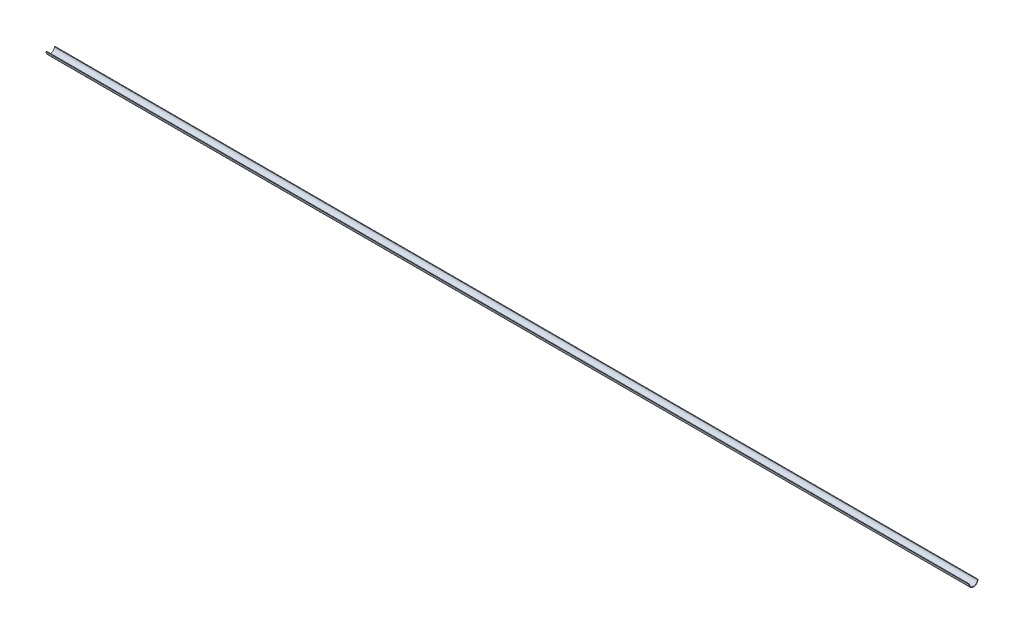
ISO-10303-21;
HEADER;
FILE_DESCRIPTION(('STEP AP214'),'2;1');
FILE_NAME('part.step','',(''),(''),'','','');
FILE_SCHEMA(('AUTOMOTIVE_DESIGN { 1 0 10303 214 1 1 1 1 }'));
ENDSEC;
DATA;
#1=APPLICATION_CONTEXT('core data for automotive mechanical design processes');
#2=APPLICATION_PROTOCOL_DEFINITION('international standard','automotive_design',2000,#1);
#3=PRODUCT_CONTEXT('',#1,'mechanical');
#4=PRODUCT('Part','Part','',(#3));
#5=PRODUCT_RELATED_PRODUCT_CATEGORY('part','',(#4));
#6=PRODUCT_DEFINITION_FORMATION('','',#4);
#7=PRODUCT_DEFINITION_CONTEXT('part definition',#1,'design');
#8=PRODUCT_DEFINITION('design','',#6,#7);
#9=PRODUCT_DEFINITION_SHAPE('','',#8);
#10=(LENGTH_UNIT() NAMED_UNIT(*) SI_UNIT(.MILLI.,.METRE.));
#11=(NAMED_UNIT(*) PLANE_ANGLE_UNIT() SI_UNIT($,.RADIAN.));
#12=(NAMED_UNIT(*) SI_UNIT($,.STERADIAN.) SOLID_ANGLE_UNIT());
#13=UNCERTAINTY_MEASURE_WITH_UNIT(LENGTH_MEASURE(1.E-05),#10,'distance_accuracy_value','');
#14=(GEOMETRIC_REPRESENTATION_CONTEXT(3) GLOBAL_UNCERTAINTY_ASSIGNED_CONTEXT((#13)) GLOBAL_UNIT_ASSIGNED_CONTEXT((#10,
#11,#12)) REPRESENTATION_CONTEXT('',''));
#15=CARTESIAN_POINT('',(0.,0.,0.));
#16=DIRECTION('',(0.,0.,1.));
#17=DIRECTION('',(1.,0.,0.));
#18=AXIS2_PLACEMENT_3D('',#15,#16,#17);
#19=CARTESIAN_POINT('',(17.653,-0.0451882551613956,0.));
#20=DIRECTION('',(-1.,0.,0.));
#21=DIRECTION('',(0.,0.,1.));
#22=AXIS2_PLACEMENT_3D('',#19,#20,#21);
#23=PLANE('',#22);
#24=DIRECTION('',(0.,0.,-1.));
#25=VECTOR('',#24,1.);
#26=CARTESIAN_POINT('',(17.653,-0.0451882551613956,0.));
#27=LINE('',#26,#25);
#28=CARTESIAN_POINT('',(17.653,-0.0451882551613956,0.0486220472440936));
#29=VERTEX_POINT('',#28);
#30=CARTESIAN_POINT('',(17.653,-0.0451882551613956,0.0419788732283465));
#31=VERTEX_POINT('',#30);
#32=EDGE_CURVE('E49',#29,#31,#27,.T.);
#33=ORIENTED_EDGE('',*,*,#32,.F.);
#34=CARTESIAN_POINT('',(17.653,-0.0451882551613956,0.));
#35=DIRECTION('',(-1.,0.,0.));
#36=DIRECTION('',(0.,0.,1.));
#37=AXIS2_PLACEMENT_3D('',#34,#35,#36);
#38=CIRCLE('',#37,0.0486220472440936);
#39=CARTESIAN_POINT('',(17.653,-0.0451882551613956,-0.0486220472440936));
#40=VERTEX_POINT('',#39);
#41=EDGE_CURVE('E79',#40,#29,#38,.T.);
#42=ORIENTED_EDGE('',*,*,#41,.F.);
#43=CARTESIAN_POINT('',(17.653,-0.0451882551613956,-0.0419788732283465));
#44=VERTEX_POINT('',#43);
#45=EDGE_CURVE('E91',#44,#40,#27,.T.);
#46=ORIENTED_EDGE('',*,*,#45,.F.);
#47=CARTESIAN_POINT('',(17.653,-0.0451882551613956,0.));
#48=DIRECTION('',(-1.,0.,0.));
#49=DIRECTION('',(0.,0.,1.));
#50=AXIS2_PLACEMENT_3D('',#47,#48,#49);
#51=CIRCLE('',#50,0.0419788732283465);
#52=EDGE_CURVE('E90',#31,#44,#51,.F.);
#53=ORIENTED_EDGE('',*,*,#52,.F.);
#54=EDGE_LOOP('',(#33,#42,#46,#53));
#55=FACE_BOUND('',#54,.T.);
#56=ADVANCED_FACE('F35',(#55),#23,.F.);
#57=CARTESIAN_POINT('',(3.847,-0.0451882551613956,0.));
#58=DIRECTION('',(-1.,0.,0.));
#59=DIRECTION('',(0.,0.,1.));
#60=AXIS2_PLACEMENT_3D('',#57,#58,#59);
#61=CYLINDRICAL_SURFACE('',#60,0.0486220472440936);
#62=DIRECTION('',(-1.,0.,0.));
#63=VECTOR('',#62,1.);
#64=CARTESIAN_POINT('',(3.847,-0.0451882551613956,-0.0486220472440936));
#65=LINE('',#64,#63);
#66=CARTESIAN_POINT('',(7.747,-0.0451882551613956,-0.0486220472440936));
#67=VERTEX_POINT('',#66);
#68=EDGE_CURVE('E94',#40,#67,#65,.T.);
#69=ORIENTED_EDGE('',*,*,#68,.F.);
#70=ORIENTED_EDGE('',*,*,#41,.T.);
#71=DIRECTION('',(-1.,0.,0.));
#72=VECTOR('',#71,1.);
#73=CARTESIAN_POINT('',(3.847,-0.0451882551613956,0.0486220472440936));
#74=LINE('',#73,#72);
#75=CARTESIAN_POINT('',(7.747,-0.0451882551613956,0.0486220472440936));
#76=VERTEX_POINT('',#75);
#77=EDGE_CURVE('E87',#76,#29,#74,.F.);
#78=ORIENTED_EDGE('',*,*,#77,.F.);
#79=CARTESIAN_POINT('',(7.747,-0.0451882551613956,0.));
#80=DIRECTION('',(-1.,0.,0.));
#81=DIRECTION('',(0.,0.,1.));
#82=AXIS2_PLACEMENT_3D('',#79,#80,#81);
#83=CIRCLE('',#82,0.0486220472440936);
#84=EDGE_CURVE('E86',#67,#76,#83,.T.);
#85=ORIENTED_EDGE('',*,*,#84,.F.);
#86=EDGE_LOOP('',(#69,#70,#78,#85));
#87=FACE_BOUND('',#86,.T.);
#88=ADVANCED_FACE('F106',(#87),#61,.T.);
#89=CARTESIAN_POINT('',(7.747,-0.0451882551613956,0.));
#90=DIRECTION('',(1.,0.,0.));
#91=DIRECTION('',(0.,0.,-1.));
#92=AXIS2_PLACEMENT_3D('',#89,#90,#91);
#93=PLANE('',#92);
#94=DIRECTION('',(0.,0.,1.));
#95=VECTOR('',#94,1.);
#96=CARTESIAN_POINT('',(7.747,-0.0451882551613956,0.));
#97=LINE('',#96,#95);
#98=CARTESIAN_POINT('',(7.747,-0.0451882551613956,-0.0419788732283465));
#99=VERTEX_POINT('',#98);
#100=EDGE_CURVE('E57',#67,#99,#97,.T.);
#101=ORIENTED_EDGE('',*,*,#100,.F.);
#102=ORIENTED_EDGE('',*,*,#84,.T.);
#103=CARTESIAN_POINT('',(7.747,-0.0451882551613956,0.0419788732283465));
#104=VERTEX_POINT('',#103);
#105=EDGE_CURVE('E73',#104,#76,#97,.T.);
#106=ORIENTED_EDGE('',*,*,#105,.F.);
#107=CARTESIAN_POINT('',(7.747,-0.0451882551613956,0.));
#108=DIRECTION('',(1.,0.,0.));
#109=DIRECTION('',(0.,0.,-1.));
#110=AXIS2_PLACEMENT_3D('',#107,#108,#109);
#111=CIRCLE('',#110,0.0419788732283465);
#112=EDGE_CURVE('E84',#99,#104,#111,.F.);
#113=ORIENTED_EDGE('',*,*,#112,.F.);
#114=EDGE_LOOP('',(#101,#102,#106,#113));
#115=FACE_BOUND('',#114,.T.);
#116=ADVANCED_FACE('F83',(#115),#93,.F.);
#117=CARTESIAN_POINT('',(27.55900078,-0.0451882551613956,0.));
#118=DIRECTION('',(-1.,0.,0.));
#119=DIRECTION('',(0.,0.,1.));
#120=AXIS2_PLACEMENT_3D('',#117,#118,#119);
#121=CYLINDRICAL_SURFACE('',#120,0.0419788732283465);
#122=ORIENTED_EDGE('',*,*,#52,.T.);
#123=DIRECTION('',(-1.,0.,0.));
#124=VECTOR('',#123,1.);
#125=CARTESIAN_POINT('',(27.55900078,-0.0451882551613956,-0.0419788732283465));
#126=LINE('',#125,#124);
#127=EDGE_CURVE('E11',#44,#99,#126,.T.);
#128=ORIENTED_EDGE('',*,*,#127,.T.);
#129=ORIENTED_EDGE('',*,*,#112,.T.);
#130=DIRECTION('',(-1.,0.,0.));
#131=VECTOR('',#130,1.);
#132=CARTESIAN_POINT('',(27.55900078,-0.0451882551613956,0.0419788732283465));
#133=LINE('',#132,#131);
#134=EDGE_CURVE('E42',#104,#31,#133,.F.);
#135=ORIENTED_EDGE('',*,*,#134,.T.);
#136=EDGE_LOOP('',(#122,#128,#129,#135));
#137=FACE_BOUND('',#136,.T.);
#138=ADVANCED_FACE('F89',(#137),#121,.F.);
#139=CARTESIAN_POINT('',(27.55900078,-0.0451882551613956,2.4765));
#140=DIRECTION('',(0.,1.,0.));
#141=DIRECTION('',(0.,0.,1.));
#142=AXIS2_PLACEMENT_3D('',#139,#140,#141);
#143=PLANE('',#142);
#144=ORIENTED_EDGE('',*,*,#32,.T.);
#145=ORIENTED_EDGE('',*,*,#134,.F.);
#146=ORIENTED_EDGE('',*,*,#105,.T.);
#147=ORIENTED_EDGE('',*,*,#77,.T.);
#148=EDGE_LOOP('',(#144,#145,#146,#147));
#149=FACE_BOUND('',#148,.T.);
#150=ADVANCED_FACE('F72',(#149),#143,.T.);
#151=ORIENTED_EDGE('',*,*,#45,.T.);
#152=ORIENTED_EDGE('',*,*,#68,.T.);
#153=ORIENTED_EDGE('',*,*,#100,.T.);
#154=ORIENTED_EDGE('',*,*,#127,.F.);
#155=EDGE_LOOP('',(#151,#152,#153,#154));
#156=FACE_BOUND('',#155,.T.);
#157=ADVANCED_FACE('F107',(#156),#143,.T.);
#158=CLOSED_SHELL('',(#56,#88,#116,#138,#150,#157));
#159=MANIFOLD_SOLID_BREP('B2',#158);
#160=ADVANCED_BREP_SHAPE_REPRESENTATION('',(#18,#159),#14);
#161=SHAPE_DEFINITION_REPRESENTATION(#9,#160);
ENDSEC;
END-ISO-10303-21;
